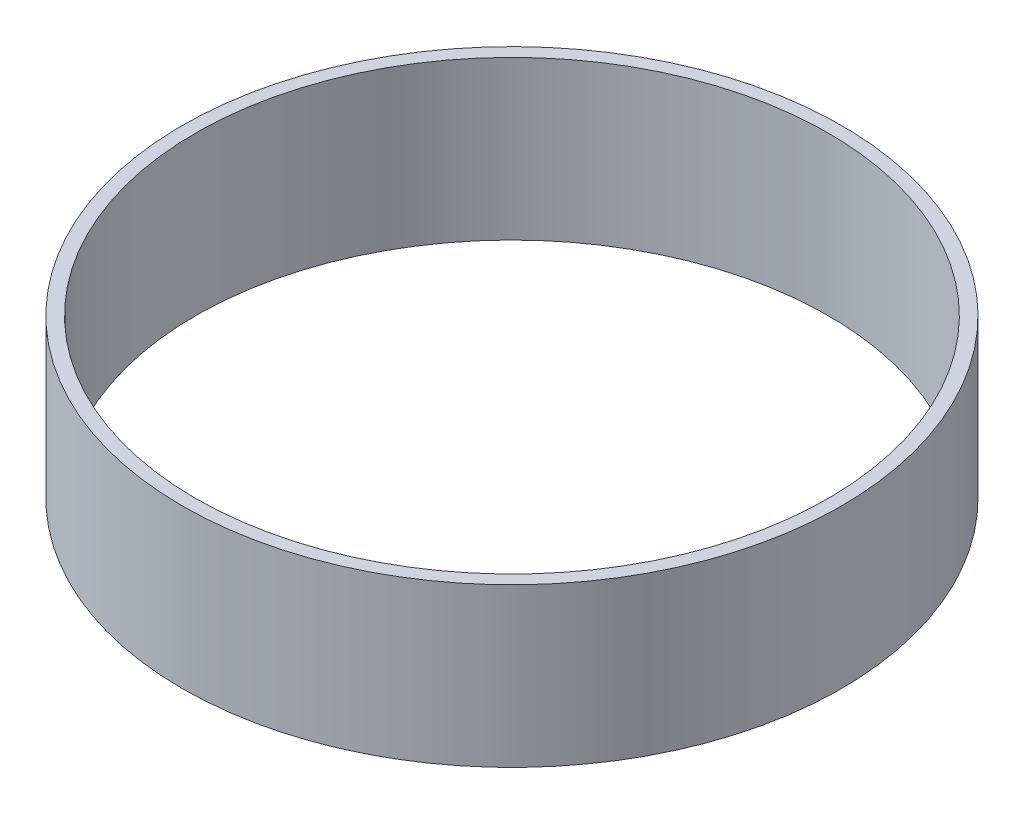
ISO-10303-21;
HEADER;
FILE_DESCRIPTION(('STEP AP214'),'2;1');
FILE_NAME('part.step','',(''),(''),'','','');
FILE_SCHEMA(('AUTOMOTIVE_DESIGN { 1 0 10303 214 1 1 1 1 }'));
ENDSEC;
DATA;
#1=APPLICATION_CONTEXT('core data for automotive mechanical design processes');
#2=APPLICATION_PROTOCOL_DEFINITION('international standard','automotive_design',2000,#1);
#3=PRODUCT_CONTEXT('',#1,'mechanical');
#4=PRODUCT('Part','Part','',(#3));
#5=PRODUCT_RELATED_PRODUCT_CATEGORY('part','',(#4));
#6=PRODUCT_DEFINITION_FORMATION('','',#4);
#7=PRODUCT_DEFINITION_CONTEXT('part definition',#1,'design');
#8=PRODUCT_DEFINITION('design','',#6,#7);
#9=PRODUCT_DEFINITION_SHAPE('','',#8);
#10=(LENGTH_UNIT() NAMED_UNIT(*) SI_UNIT(.MILLI.,.METRE.));
#11=(NAMED_UNIT(*) PLANE_ANGLE_UNIT() SI_UNIT($,.RADIAN.));
#12=(NAMED_UNIT(*) SI_UNIT($,.STERADIAN.) SOLID_ANGLE_UNIT());
#13=UNCERTAINTY_MEASURE_WITH_UNIT(LENGTH_MEASURE(1.E-05),#10,'distance_accuracy_value','');
#14=(GEOMETRIC_REPRESENTATION_CONTEXT(3) GLOBAL_UNCERTAINTY_ASSIGNED_CONTEXT((#13)) GLOBAL_UNIT_ASSIGNED_CONTEXT((#10,
#11,#12)) REPRESENTATION_CONTEXT('',''));
#15=CARTESIAN_POINT('',(0.,0.,0.));
#16=DIRECTION('',(0.,0.,1.));
#17=DIRECTION('',(1.,0.,0.));
#18=AXIS2_PLACEMENT_3D('',#15,#16,#17);
#19=CARTESIAN_POINT('',(0.,-76.2,0.));
#20=DIRECTION('',(0.,1.,0.));
#21=DIRECTION('',(0.,0.,1.));
#22=AXIS2_PLACEMENT_3D('',#19,#20,#21);
#23=CYLINDRICAL_SURFACE('',#22,158.75);
#24=CARTESIAN_POINT('',(0.,-76.2,0.));
#25=DIRECTION('',(0.,1.,0.));
#26=DIRECTION('',(0.,0.,1.));
#27=AXIS2_PLACEMENT_3D('',#24,#25,#26);
#28=CIRCLE('',#27,158.75);
#29=CARTESIAN_POINT('',(0.,-76.2,158.75));
#30=VERTEX_POINT('',#29);
#31=EDGE_CURVE('E12',#30,#30,#28,.T.);
#32=ORIENTED_EDGE('',*,*,#31,.T.);
#33=EDGE_LOOP('',(#32));
#34=FACE_BOUND('',#33,.T.);
#35=CARTESIAN_POINT('',(0.,0.,0.));
#36=DIRECTION('',(0.,1.,0.));
#37=DIRECTION('',(0.,0.,1.));
#38=AXIS2_PLACEMENT_3D('',#35,#36,#37);
#39=CIRCLE('',#38,158.75);
#40=CARTESIAN_POINT('',(0.,0.,158.75));
#41=VERTEX_POINT('',#40);
#42=EDGE_CURVE('E48',#41,#41,#39,.T.);
#43=ORIENTED_EDGE('',*,*,#42,.F.);
#44=EDGE_LOOP('',(#43));
#45=FACE_BOUND('',#44,.T.);
#46=ADVANCED_FACE('F45',(#34,#45),#23,.T.);
#47=CARTESIAN_POINT('',(0.,-76.2,0.));
#48=DIRECTION('',(0.,1.,0.));
#49=DIRECTION('',(0.,0.,1.));
#50=AXIS2_PLACEMENT_3D('',#47,#48,#49);
#51=PLANE('',#50);
#52=CARTESIAN_POINT('',(0.,-76.2,0.));
#53=DIRECTION('',(0.,1.,0.));
#54=DIRECTION('',(0.,0.,1.));
#55=AXIS2_PLACEMENT_3D('',#52,#53,#54);
#56=CIRCLE('',#55,152.4);
#57=CARTESIAN_POINT('',(0.,-76.2,152.4));
#58=VERTEX_POINT('',#57);
#59=EDGE_CURVE('E55',#58,#58,#56,.T.);
#60=ORIENTED_EDGE('',*,*,#59,.T.);
#61=EDGE_LOOP('',(#60));
#62=FACE_BOUND('',#61,.T.);
#63=ORIENTED_EDGE('',*,*,#31,.F.);
#64=EDGE_LOOP('',(#63));
#65=FACE_BOUND('',#64,.T.);
#66=ADVANCED_FACE('F63',(#62,#65),#51,.F.);
#67=CARTESIAN_POINT('',(0.,0.,0.));
#68=DIRECTION('',(0.,1.,0.));
#69=DIRECTION('',(0.,0.,1.));
#70=AXIS2_PLACEMENT_3D('',#67,#68,#69);
#71=PLANE('',#70);
#72=CARTESIAN_POINT('',(0.,0.,0.));
#73=DIRECTION('',(0.,1.,0.));
#74=DIRECTION('',(0.,0.,1.));
#75=AXIS2_PLACEMENT_3D('',#72,#73,#74);
#76=CIRCLE('',#75,152.4);
#77=CARTESIAN_POINT('',(0.,0.,152.4));
#78=VERTEX_POINT('',#77);
#79=EDGE_CURVE('E57',#78,#78,#76,.T.);
#80=ORIENTED_EDGE('',*,*,#79,.F.);
#81=EDGE_LOOP('',(#80));
#82=FACE_BOUND('',#81,.T.);
#83=ORIENTED_EDGE('',*,*,#42,.T.);
#84=EDGE_LOOP('',(#83));
#85=FACE_BOUND('',#84,.T.);
#86=ADVANCED_FACE('F69',(#82,#85),#71,.T.);
#87=CARTESIAN_POINT('',(0.,-76.2,0.));
#88=DIRECTION('',(0.,1.,0.));
#89=DIRECTION('',(0.,0.,1.));
#90=AXIS2_PLACEMENT_3D('',#87,#88,#89);
#91=CYLINDRICAL_SURFACE('',#90,152.4);
#92=ORIENTED_EDGE('',*,*,#59,.F.);
#93=EDGE_LOOP('',(#92));
#94=FACE_BOUND('',#93,.T.);
#95=ORIENTED_EDGE('',*,*,#79,.T.);
#96=EDGE_LOOP('',(#95));
#97=FACE_BOUND('',#96,.T.);
#98=ADVANCED_FACE('F66',(#94,#97),#91,.F.);
#99=CLOSED_SHELL('',(#46,#66,#86,#98));
#100=MANIFOLD_SOLID_BREP('B2',#99);
#101=ADVANCED_BREP_SHAPE_REPRESENTATION('',(#18,#100),#14);
#102=SHAPE_DEFINITION_REPRESENTATION(#9,#101);
ENDSEC;
END-ISO-10303-21;
